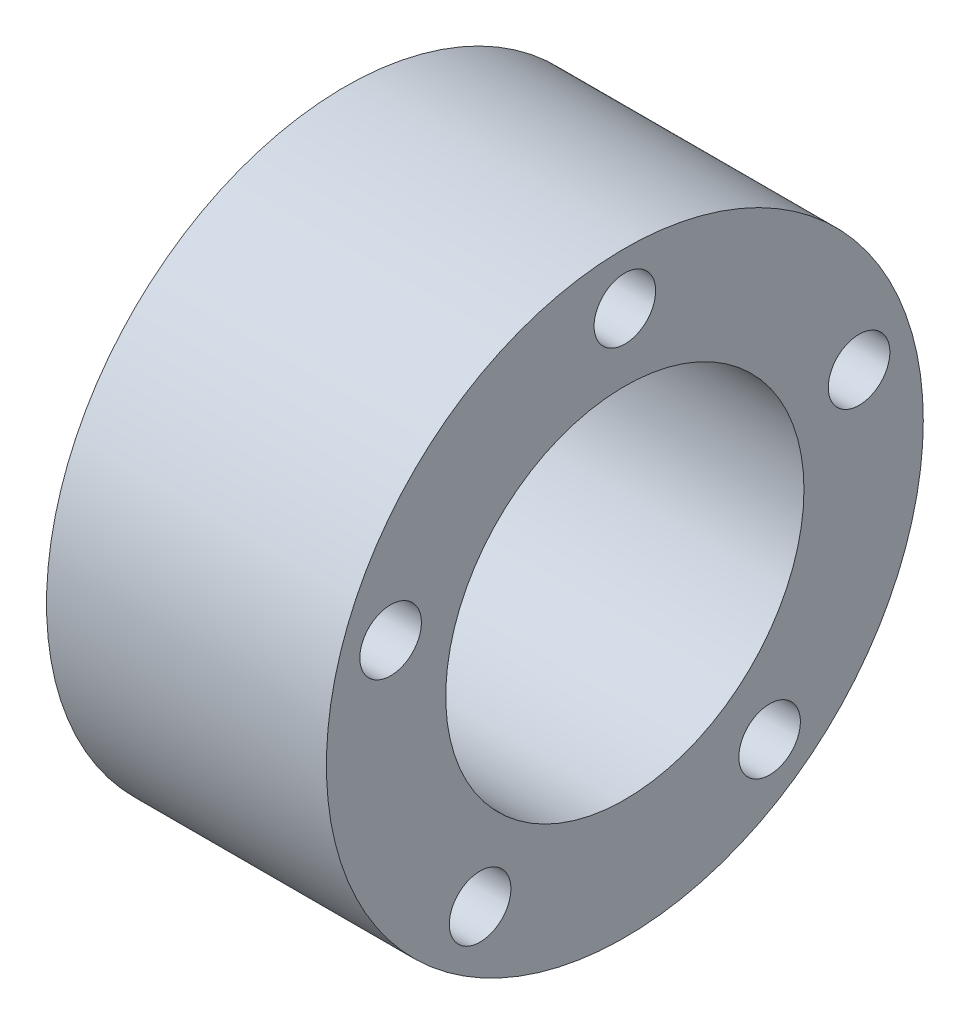
ISO-10303-21;
HEADER;
FILE_DESCRIPTION(('STEP AP214'),'2;1');
FILE_NAME('part.step','',(''),(''),'','','');
FILE_SCHEMA(('AUTOMOTIVE_DESIGN { 1 0 10303 214 1 1 1 1 }'));
ENDSEC;
DATA;
#1=APPLICATION_CONTEXT('core data for automotive mechanical design processes');
#2=APPLICATION_PROTOCOL_DEFINITION('international standard','automotive_design',2000,#1);
#3=PRODUCT_CONTEXT('',#1,'mechanical');
#4=PRODUCT('Part','Part','',(#3));
#5=PRODUCT_RELATED_PRODUCT_CATEGORY('part','',(#4));
#6=PRODUCT_DEFINITION_FORMATION('','',#4);
#7=PRODUCT_DEFINITION_CONTEXT('part definition',#1,'design');
#8=PRODUCT_DEFINITION('design','',#6,#7);
#9=PRODUCT_DEFINITION_SHAPE('','',#8);
#10=(LENGTH_UNIT() NAMED_UNIT(*) SI_UNIT(.MILLI.,.METRE.));
#11=(NAMED_UNIT(*) PLANE_ANGLE_UNIT() SI_UNIT($,.RADIAN.));
#12=(NAMED_UNIT(*) SI_UNIT($,.STERADIAN.) SOLID_ANGLE_UNIT());
#13=UNCERTAINTY_MEASURE_WITH_UNIT(LENGTH_MEASURE(1.E-05),#10,'distance_accuracy_value','');
#14=(GEOMETRIC_REPRESENTATION_CONTEXT(3) GLOBAL_UNCERTAINTY_ASSIGNED_CONTEXT((#13)) GLOBAL_UNIT_ASSIGNED_CONTEXT((#10,
#11,#12)) REPRESENTATION_CONTEXT('',''));
#15=CARTESIAN_POINT('',(0.,0.,0.));
#16=DIRECTION('',(0.,0.,1.));
#17=DIRECTION('',(1.,0.,0.));
#18=AXIS2_PLACEMENT_3D('',#15,#16,#17);
#19=CARTESIAN_POINT('',(12.7,0.,0.));
#20=DIRECTION('',(1.,0.,0.));
#21=DIRECTION('',(0.,0.,-1.));
#22=AXIS2_PLACEMENT_3D('',#19,#20,#21);
#23=PLANE('',#22);
#24=CARTESIAN_POINT('',(12.7,11.176,0.));
#25=DIRECTION('',(-1.,0.,0.));
#26=DIRECTION('',(0.,0.,1.));
#27=AXIS2_PLACEMENT_3D('',#24,#25,#26);
#28=CIRCLE('',#27,1.397);
#29=CARTESIAN_POINT('',(12.7,11.176,1.397));
#30=VERTEX_POINT('',#29);
#31=EDGE_CURVE('E71',#30,#30,#28,.T.);
#32=ORIENTED_EDGE('',*,*,#31,.T.);
#33=EDGE_LOOP('',(#32));
#34=FACE_BOUND('',#33,.T.);
#35=CARTESIAN_POINT('',(12.7,3.45357392913441,10.6290076261146));
#36=DIRECTION('',(-1.,0.,0.));
#37=DIRECTION('',(0.,0.,1.));
#38=AXIS2_PLACEMENT_3D('',#35,#36,#37);
#39=CIRCLE('',#38,1.397);
#40=CARTESIAN_POINT('',(12.7,3.45357392913441,12.0260076261146));
#41=VERTEX_POINT('',#40);
#42=EDGE_CURVE('E88',#41,#41,#39,.T.);
#43=ORIENTED_EDGE('',*,*,#42,.T.);
#44=EDGE_LOOP('',(#43));
#45=FACE_BOUND('',#44,.T.);
#46=CARTESIAN_POINT('',(12.7,-9.04157392913441,6.56908797962068));
#47=DIRECTION('',(-1.,0.,0.));
#48=DIRECTION('',(0.,0.,1.));
#49=AXIS2_PLACEMENT_3D('',#46,#47,#48);
#50=CIRCLE('',#49,1.397);
#51=CARTESIAN_POINT('',(12.7,-9.04157392913441,7.96608797962068));
#52=VERTEX_POINT('',#51);
#53=EDGE_CURVE('E94',#52,#52,#50,.T.);
#54=ORIENTED_EDGE('',*,*,#53,.T.);
#55=EDGE_LOOP('',(#54));
#56=FACE_BOUND('',#55,.T.);
#57=CARTESIAN_POINT('',(12.7,-9.04157392913441,-6.56908797962068));
#58=DIRECTION('',(-1.,0.,0.));
#59=DIRECTION('',(0.,0.,1.));
#60=AXIS2_PLACEMENT_3D('',#57,#58,#59);
#61=CIRCLE('',#60,1.397);
#62=CARTESIAN_POINT('',(12.7,-9.04157392913441,-5.17208797962068));
#63=VERTEX_POINT('',#62);
#64=EDGE_CURVE('E100',#63,#63,#61,.T.);
#65=ORIENTED_EDGE('',*,*,#64,.T.);
#66=EDGE_LOOP('',(#65));
#67=FACE_BOUND('',#66,.T.);
#68=CARTESIAN_POINT('',(12.7,3.45357392913441,-10.6290076261146));
#69=DIRECTION('',(-1.,0.,0.));
#70=DIRECTION('',(0.,0.,1.));
#71=AXIS2_PLACEMENT_3D('',#68,#69,#70);
#72=CIRCLE('',#71,1.397);
#73=CARTESIAN_POINT('',(12.7,3.45357392913441,-9.23200762611464));
#74=VERTEX_POINT('',#73);
#75=EDGE_CURVE('E61',#74,#74,#72,.T.);
#76=ORIENTED_EDGE('',*,*,#75,.T.);
#77=EDGE_LOOP('',(#76));
#78=FACE_BOUND('',#77,.T.);
#79=CARTESIAN_POINT('',(12.7,0.,0.));
#80=DIRECTION('',(1.,0.,0.));
#81=DIRECTION('',(0.,0.,-1.));
#82=AXIS2_PLACEMENT_3D('',#79,#80,#81);
#83=CIRCLE('',#82,13.543461356);
#84=CARTESIAN_POINT('',(12.7,0.,-13.543461356));
#85=VERTEX_POINT('',#84);
#86=EDGE_CURVE('E11',#85,#85,#83,.T.);
#87=ORIENTED_EDGE('',*,*,#86,.T.);
#88=EDGE_LOOP('',(#87));
#89=FACE_BOUND('',#88,.T.);
#90=CARTESIAN_POINT('',(12.7,0.,0.));
#91=DIRECTION('',(1.,0.,0.));
#92=DIRECTION('',(0.,0.,-1.));
#93=AXIS2_PLACEMENT_3D('',#90,#91,#92);
#94=CIRCLE('',#93,8.128);
#95=CARTESIAN_POINT('',(12.7,0.,-8.128));
#96=VERTEX_POINT('',#95);
#97=EDGE_CURVE('E52',#96,#96,#94,.T.);
#98=ORIENTED_EDGE('',*,*,#97,.F.);
#99=EDGE_LOOP('',(#98));
#100=FACE_BOUND('',#99,.T.);
#101=ADVANCED_FACE('F41',(#34,#45,#56,#67,#78,#89,#100),#23,.T.);
#102=CARTESIAN_POINT('',(0.,0.,0.));
#103=DIRECTION('',(1.,0.,0.));
#104=DIRECTION('',(0.,0.,-1.));
#105=AXIS2_PLACEMENT_3D('',#102,#103,#104);
#106=PLANE('',#105);
#107=CARTESIAN_POINT('',(0.,11.176,0.));
#108=DIRECTION('',(-1.,0.,0.));
#109=DIRECTION('',(0.,0.,1.));
#110=AXIS2_PLACEMENT_3D('',#107,#108,#109);
#111=CIRCLE('',#110,1.397);
#112=CARTESIAN_POINT('',(0.,11.176,1.397));
#113=VERTEX_POINT('',#112);
#114=EDGE_CURVE('E75',#113,#113,#111,.T.);
#115=ORIENTED_EDGE('',*,*,#114,.F.);
#116=EDGE_LOOP('',(#115));
#117=FACE_BOUND('',#116,.T.);
#118=CARTESIAN_POINT('',(0.,3.45357392913441,10.6290076261146));
#119=DIRECTION('',(-1.,0.,0.));
#120=DIRECTION('',(0.,0.,1.));
#121=AXIS2_PLACEMENT_3D('',#118,#119,#120);
#122=CIRCLE('',#121,1.397);
#123=CARTESIAN_POINT('',(0.,3.45357392913441,12.0260076261146));
#124=VERTEX_POINT('',#123);
#125=EDGE_CURVE('E80',#124,#124,#122,.T.);
#126=ORIENTED_EDGE('',*,*,#125,.F.);
#127=EDGE_LOOP('',(#126));
#128=FACE_BOUND('',#127,.T.);
#129=CARTESIAN_POINT('',(0.,-9.04157392913441,6.56908797962068));
#130=DIRECTION('',(-1.,0.,0.));
#131=DIRECTION('',(0.,0.,1.));
#132=AXIS2_PLACEMENT_3D('',#129,#130,#131);
#133=CIRCLE('',#132,1.397);
#134=CARTESIAN_POINT('',(0.,-9.04157392913441,7.96608797962068));
#135=VERTEX_POINT('',#134);
#136=EDGE_CURVE('E92',#135,#135,#133,.T.);
#137=ORIENTED_EDGE('',*,*,#136,.F.);
#138=EDGE_LOOP('',(#137));
#139=FACE_BOUND('',#138,.T.);
#140=CARTESIAN_POINT('',(0.,-9.04157392913441,-6.56908797962068));
#141=DIRECTION('',(-1.,0.,0.));
#142=DIRECTION('',(0.,0.,1.));
#143=AXIS2_PLACEMENT_3D('',#140,#141,#142);
#144=CIRCLE('',#143,1.397);
#145=CARTESIAN_POINT('',(0.,-9.04157392913441,-5.17208797962068));
#146=VERTEX_POINT('',#145);
#147=EDGE_CURVE('E98',#146,#146,#144,.T.);
#148=ORIENTED_EDGE('',*,*,#147,.F.);
#149=EDGE_LOOP('',(#148));
#150=FACE_BOUND('',#149,.T.);
#151=CARTESIAN_POINT('',(0.,3.45357392913441,-10.6290076261146));
#152=DIRECTION('',(-1.,0.,0.));
#153=DIRECTION('',(0.,0.,1.));
#154=AXIS2_PLACEMENT_3D('',#151,#152,#153);
#155=CIRCLE('',#154,1.397);
#156=CARTESIAN_POINT('',(0.,3.45357392913441,-9.23200762611464));
#157=VERTEX_POINT('',#156);
#158=EDGE_CURVE('E65',#157,#157,#155,.T.);
#159=ORIENTED_EDGE('',*,*,#158,.F.);
#160=EDGE_LOOP('',(#159));
#161=FACE_BOUND('',#160,.T.);
#162=CARTESIAN_POINT('',(0.,0.,0.));
#163=DIRECTION('',(1.,0.,0.));
#164=DIRECTION('',(0.,0.,-1.));
#165=AXIS2_PLACEMENT_3D('',#162,#163,#164);
#166=CIRCLE('',#165,13.543461356);
#167=CARTESIAN_POINT('',(0.,0.,-13.543461356));
#168=VERTEX_POINT('',#167);
#169=EDGE_CURVE('E45',#168,#168,#166,.T.);
#170=ORIENTED_EDGE('',*,*,#169,.F.);
#171=EDGE_LOOP('',(#170));
#172=FACE_BOUND('',#171,.T.);
#173=CARTESIAN_POINT('',(0.,0.,0.));
#174=DIRECTION('',(1.,0.,0.));
#175=DIRECTION('',(0.,0.,-1.));
#176=AXIS2_PLACEMENT_3D('',#173,#174,#175);
#177=CIRCLE('',#176,8.128);
#178=CARTESIAN_POINT('',(0.,0.,-8.128));
#179=VERTEX_POINT('',#178);
#180=EDGE_CURVE('E55',#179,#179,#177,.T.);
#181=ORIENTED_EDGE('',*,*,#180,.T.);
#182=EDGE_LOOP('',(#181));
#183=FACE_BOUND('',#182,.T.);
#184=ADVANCED_FACE('F110',(#117,#128,#139,#150,#161,#172,#183),#106,.F.);
#185=CARTESIAN_POINT('',(12.7,0.,0.));
#186=DIRECTION('',(-1.,0.,0.));
#187=DIRECTION('',(0.,0.,1.));
#188=AXIS2_PLACEMENT_3D('',#185,#186,#187);
#189=CYLINDRICAL_SURFACE('',#188,13.543461356);
#190=ORIENTED_EDGE('',*,*,#86,.F.);
#191=EDGE_LOOP('',(#190));
#192=FACE_BOUND('',#191,.T.);
#193=ORIENTED_EDGE('',*,*,#169,.T.);
#194=EDGE_LOOP('',(#193));
#195=FACE_BOUND('',#194,.T.);
#196=ADVANCED_FACE('F43',(#192,#195),#189,.T.);
#197=CARTESIAN_POINT('',(12.7,0.,0.));
#198=DIRECTION('',(-1.,0.,0.));
#199=DIRECTION('',(0.,0.,1.));
#200=AXIS2_PLACEMENT_3D('',#197,#198,#199);
#201=CYLINDRICAL_SURFACE('',#200,8.128);
#202=ORIENTED_EDGE('',*,*,#97,.T.);
#203=EDGE_LOOP('',(#202));
#204=FACE_BOUND('',#203,.T.);
#205=ORIENTED_EDGE('',*,*,#180,.F.);
#206=EDGE_LOOP('',(#205));
#207=FACE_BOUND('',#206,.T.);
#208=ADVANCED_FACE('F117',(#204,#207),#201,.F.);
#209=CARTESIAN_POINT('',(12.7,3.45357392913441,-10.6290076261146));
#210=DIRECTION('',(-1.,0.,0.));
#211=DIRECTION('',(0.,0.,1.));
#212=AXIS2_PLACEMENT_3D('',#209,#210,#211);
#213=CYLINDRICAL_SURFACE('',#212,1.397);
#214=ORIENTED_EDGE('',*,*,#75,.F.);
#215=EDGE_LOOP('',(#214));
#216=FACE_BOUND('',#215,.T.);
#217=ORIENTED_EDGE('',*,*,#158,.T.);
#218=EDGE_LOOP('',(#217));
#219=FACE_BOUND('',#218,.T.);
#220=ADVANCED_FACE('F108',(#216,#219),#213,.F.);
#221=CARTESIAN_POINT('',(12.7,-9.04157392913441,-6.56908797962068));
#222=DIRECTION('',(-1.,0.,0.));
#223=DIRECTION('',(0.,0.,1.));
#224=AXIS2_PLACEMENT_3D('',#221,#222,#223);
#225=CYLINDRICAL_SURFACE('',#224,1.397);
#226=ORIENTED_EDGE('',*,*,#64,.F.);
#227=EDGE_LOOP('',(#226));
#228=FACE_BOUND('',#227,.T.);
#229=ORIENTED_EDGE('',*,*,#147,.T.);
#230=EDGE_LOOP('',(#229));
#231=FACE_BOUND('',#230,.T.);
#232=ADVANCED_FACE('F131',(#228,#231),#225,.F.);
#233=CARTESIAN_POINT('',(12.7,-9.04157392913441,6.56908797962068));
#234=DIRECTION('',(-1.,0.,0.));
#235=DIRECTION('',(0.,0.,1.));
#236=AXIS2_PLACEMENT_3D('',#233,#234,#235);
#237=CYLINDRICAL_SURFACE('',#236,1.397);
#238=ORIENTED_EDGE('',*,*,#53,.F.);
#239=EDGE_LOOP('',(#238));
#240=FACE_BOUND('',#239,.T.);
#241=ORIENTED_EDGE('',*,*,#136,.T.);
#242=EDGE_LOOP('',(#241));
#243=FACE_BOUND('',#242,.T.);
#244=ADVANCED_FACE('F135',(#240,#243),#237,.F.);
#245=CARTESIAN_POINT('',(12.7,3.45357392913441,10.6290076261146));
#246=DIRECTION('',(-1.,0.,0.));
#247=DIRECTION('',(0.,0.,1.));
#248=AXIS2_PLACEMENT_3D('',#245,#246,#247);
#249=CYLINDRICAL_SURFACE('',#248,1.397);
#250=ORIENTED_EDGE('',*,*,#42,.F.);
#251=EDGE_LOOP('',(#250));
#252=FACE_BOUND('',#251,.T.);
#253=ORIENTED_EDGE('',*,*,#125,.T.);
#254=EDGE_LOOP('',(#253));
#255=FACE_BOUND('',#254,.T.);
#256=ADVANCED_FACE('F139',(#252,#255),#249,.F.);
#257=CARTESIAN_POINT('',(12.7,11.176,0.));
#258=DIRECTION('',(-1.,0.,0.));
#259=DIRECTION('',(0.,0.,1.));
#260=AXIS2_PLACEMENT_3D('',#257,#258,#259);
#261=CYLINDRICAL_SURFACE('',#260,1.397);
#262=ORIENTED_EDGE('',*,*,#31,.F.);
#263=EDGE_LOOP('',(#262));
#264=FACE_BOUND('',#263,.T.);
#265=ORIENTED_EDGE('',*,*,#114,.T.);
#266=EDGE_LOOP('',(#265));
#267=FACE_BOUND('',#266,.T.);
#268=ADVANCED_FACE('F143',(#264,#267),#261,.F.);
#269=CLOSED_SHELL('',(#101,#184,#196,#208,#220,#232,#244,#256,#268));
#270=MANIFOLD_SOLID_BREP('B2',#269);
#271=ADVANCED_BREP_SHAPE_REPRESENTATION('',(#18,#270),#14);
#272=SHAPE_DEFINITION_REPRESENTATION(#9,#271);
ENDSEC;
END-ISO-10303-21;
